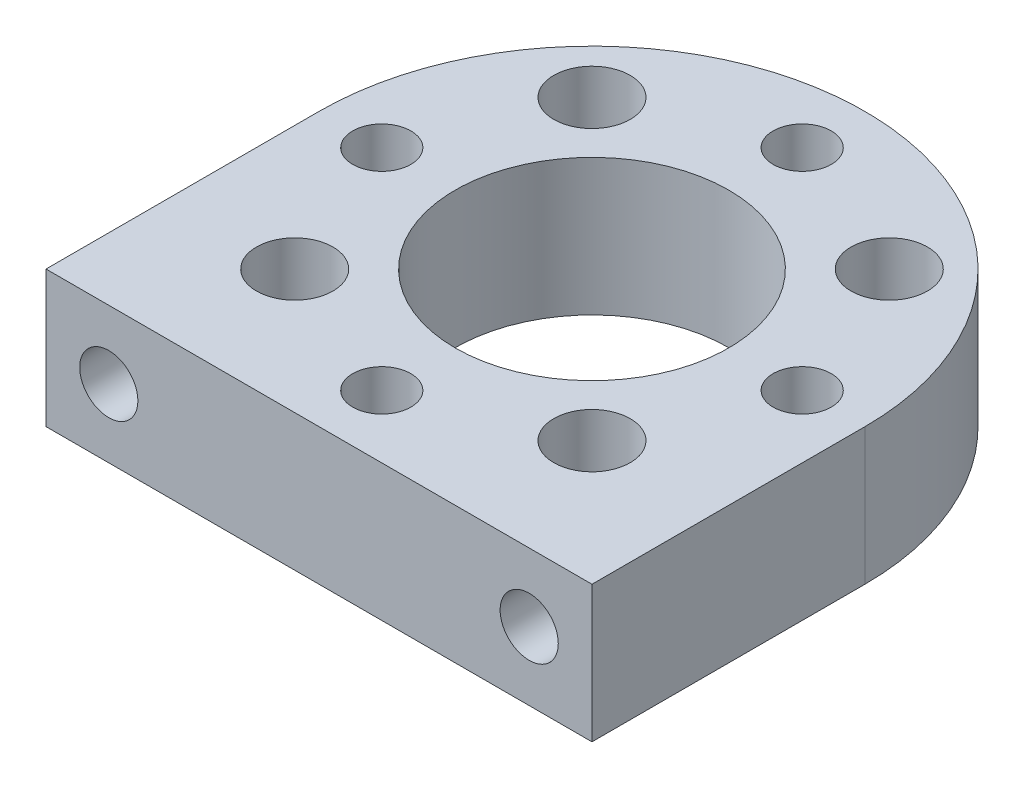
ISO-10303-21;
HEADER;
FILE_DESCRIPTION(('STEP AP214'),'2;1');
FILE_NAME('part.step','',(''),(''),'','','');
FILE_SCHEMA(('AUTOMOTIVE_DESIGN { 1 0 10303 214 1 1 1 1 }'));
ENDSEC;
DATA;
#1=APPLICATION_CONTEXT('core data for automotive mechanical design processes');
#2=APPLICATION_PROTOCOL_DEFINITION('international standard','automotive_design',2000,#1);
#3=PRODUCT_CONTEXT('',#1,'mechanical');
#4=PRODUCT('Part','Part','',(#3));
#5=PRODUCT_RELATED_PRODUCT_CATEGORY('part','',(#4));
#6=PRODUCT_DEFINITION_FORMATION('','',#4);
#7=PRODUCT_DEFINITION_CONTEXT('part definition',#1,'design');
#8=PRODUCT_DEFINITION('design','',#6,#7);
#9=PRODUCT_DEFINITION_SHAPE('','',#8);
#10=(LENGTH_UNIT() NAMED_UNIT(*) SI_UNIT(.MILLI.,.METRE.));
#11=(NAMED_UNIT(*) PLANE_ANGLE_UNIT() SI_UNIT($,.RADIAN.));
#12=(NAMED_UNIT(*) SI_UNIT($,.STERADIAN.) SOLID_ANGLE_UNIT());
#13=UNCERTAINTY_MEASURE_WITH_UNIT(LENGTH_MEASURE(1.E-05),#10,'distance_accuracy_value','');
#14=(GEOMETRIC_REPRESENTATION_CONTEXT(3) GLOBAL_UNCERTAINTY_ASSIGNED_CONTEXT((#13)) GLOBAL_UNIT_ASSIGNED_CONTEXT((#10,
#11,#12)) REPRESENTATION_CONTEXT('',''));
#15=CARTESIAN_POINT('',(0.,0.,0.));
#16=DIRECTION('',(0.,0.,1.));
#17=DIRECTION('',(1.,0.,0.));
#18=AXIS2_PLACEMENT_3D('',#15,#16,#17);
#19=CARTESIAN_POINT('',(-9.779,3.175,8.38200000004008));
#20=DIRECTION('',(0.,0.,1.));
#21=DIRECTION('',(1.,0.,0.));
#22=AXIS2_PLACEMENT_3D('',#19,#20,#21);
#23=CONICAL_SURFACE('',#22,1.35255000011194,1.02974425867655);
#24=CARTESIAN_POINT('',(-9.77899999980991,3.175,7.5693059697528));
#25=VERTEX_POINT('',#24);
#26=VERTEX_LOOP('',#25);
#27=FACE_BOUND('',#26,.T.);
#28=CARTESIAN_POINT('',(-9.779,3.175,8.382));
#29=DIRECTION('',(0.,0.,1.));
#30=DIRECTION('',(1.,0.,0.));
#31=AXIS2_PLACEMENT_3D('',#28,#29,#30);
#32=CIRCLE('',#31,1.35254999999999);
#33=CARTESIAN_POINT('',(-8.42645000000001,3.175,8.382));
#34=VERTEX_POINT('',#33);
#35=EDGE_CURVE('E167',#34,#34,#32,.T.);
#36=ORIENTED_EDGE('',*,*,#35,.T.);
#37=EDGE_LOOP('',(#36));
#38=FACE_BOUND('',#37,.T.);
#39=ADVANCED_FACE('F17',(#27,#38),#23,.F.);
#40=CARTESIAN_POINT('',(9.779,3.175,8.38199999998324));
#41=DIRECTION('',(0.,0.,1.));
#42=DIRECTION('',(1.,0.,0.));
#43=AXIS2_PLACEMENT_3D('',#40,#41,#42);
#44=CONICAL_SURFACE('',#43,1.35255000012966,1.0297442587012);
#45=CARTESIAN_POINT('',(9.77900000015097,3.175,7.56930596978123));
#46=VERTEX_POINT('',#45);
#47=VERTEX_LOOP('',#46);
#48=FACE_BOUND('',#47,.T.);
#49=CARTESIAN_POINT('',(9.779,3.175,8.382));
#50=DIRECTION('',(0.,0.,1.));
#51=DIRECTION('',(1.,0.,0.));
#52=AXIS2_PLACEMENT_3D('',#49,#50,#51);
#53=CIRCLE('',#52,1.35254999999999);
#54=CARTESIAN_POINT('',(11.13155,3.175,8.382));
#55=VERTEX_POINT('',#54);
#56=EDGE_CURVE('E163',#55,#55,#53,.T.);
#57=ORIENTED_EDGE('',*,*,#56,.T.);
#58=EDGE_LOOP('',(#57));
#59=FACE_BOUND('',#58,.T.);
#60=ADVANCED_FACE('F263',(#48,#59),#44,.F.);
#61=CARTESIAN_POINT('',(-9.779,3.175,12.7));
#62=DIRECTION('',(0.,0.,1.));
#63=DIRECTION('',(1.,0.,0.));
#64=AXIS2_PLACEMENT_3D('',#61,#62,#63);
#65=CYLINDRICAL_SURFACE('',#64,1.35254999999999);
#66=CARTESIAN_POINT('',(-9.779,3.175,12.7));
#67=DIRECTION('',(0.,0.,1.));
#68=DIRECTION('',(1.,0.,0.));
#69=AXIS2_PLACEMENT_3D('',#66,#67,#68);
#70=CIRCLE('',#69,1.35254999999999);
#71=CARTESIAN_POINT('',(-8.42645000000001,3.175,12.7));
#72=VERTEX_POINT('',#71);
#73=EDGE_CURVE('E135',#72,#72,#70,.F.);
#74=ORIENTED_EDGE('',*,*,#73,.F.);
#75=EDGE_LOOP('',(#74));
#76=FACE_BOUND('',#75,.T.);
#77=ORIENTED_EDGE('',*,*,#35,.F.);
#78=EDGE_LOOP('',(#77));
#79=FACE_BOUND('',#78,.T.);
#80=ADVANCED_FACE('F260',(#76,#79),#65,.F.);
#81=CARTESIAN_POINT('',(9.779,3.175,12.7));
#82=DIRECTION('',(0.,0.,1.));
#83=DIRECTION('',(1.,0.,0.));
#84=AXIS2_PLACEMENT_3D('',#81,#82,#83);
#85=CYLINDRICAL_SURFACE('',#84,1.35254999999999);
#86=CARTESIAN_POINT('',(9.779,3.175,12.7));
#87=DIRECTION('',(0.,0.,1.));
#88=DIRECTION('',(1.,0.,0.));
#89=AXIS2_PLACEMENT_3D('',#86,#87,#88);
#90=CIRCLE('',#89,1.35254999999999);
#91=CARTESIAN_POINT('',(11.13155,3.175,12.7));
#92=VERTEX_POINT('',#91);
#93=EDGE_CURVE('E131',#92,#92,#90,.F.);
#94=ORIENTED_EDGE('',*,*,#93,.F.);
#95=EDGE_LOOP('',(#94));
#96=FACE_BOUND('',#95,.T.);
#97=ORIENTED_EDGE('',*,*,#56,.F.);
#98=EDGE_LOOP('',(#97));
#99=FACE_BOUND('',#98,.T.);
#100=ADVANCED_FACE('F257',(#96,#99),#85,.F.);
#101=CARTESIAN_POINT('',(0.,0.,0.));
#102=DIRECTION('',(0.,1.,0.));
#103=DIRECTION('',(0.,0.,1.));
#104=AXIS2_PLACEMENT_3D('',#101,#102,#103);
#105=PLANE('',#104);
#106=DIRECTION('',(0.,0.,-1.));
#107=VECTOR('',#106,1.);
#108=CARTESIAN_POINT('',(12.7,0.,0.));
#109=LINE('',#108,#107);
#110=CARTESIAN_POINT('',(12.7,0.,12.7));
#111=VERTEX_POINT('',#110);
#112=CARTESIAN_POINT('',(12.7,0.,0.));
#113=VERTEX_POINT('',#112);
#114=EDGE_CURVE('E58',#111,#113,#109,.T.);
#115=ORIENTED_EDGE('',*,*,#114,.F.);
#116=DIRECTION('',(1.,0.,0.));
#117=VECTOR('',#116,1.);
#118=CARTESIAN_POINT('',(0.,0.,12.7));
#119=LINE('',#118,#117);
#120=CARTESIAN_POINT('',(-12.7,0.,12.7));
#121=VERTEX_POINT('',#120);
#122=EDGE_CURVE('E134',#121,#111,#119,.T.);
#123=ORIENTED_EDGE('',*,*,#122,.F.);
#124=DIRECTION('',(0.,0.,1.));
#125=VECTOR('',#124,1.);
#126=CARTESIAN_POINT('',(-12.7,0.,0.));
#127=LINE('',#126,#125);
#128=CARTESIAN_POINT('',(-12.7,0.,0.));
#129=VERTEX_POINT('',#128);
#130=EDGE_CURVE('E48',#129,#121,#127,.T.);
#131=ORIENTED_EDGE('',*,*,#130,.F.);
#132=CARTESIAN_POINT('',(0.,0.,0.));
#133=DIRECTION('',(0.,-1.,0.));
#134=DIRECTION('',(0.,0.,-1.));
#135=AXIS2_PLACEMENT_3D('',#132,#133,#134);
#136=CIRCLE('',#135,12.7);
#137=EDGE_CURVE('E54',#113,#129,#136,.F.);
#138=ORIENTED_EDGE('',*,*,#137,.F.);
#139=EDGE_LOOP('',(#115,#123,#131,#138));
#140=FACE_BOUND('',#139,.T.);
#141=CARTESIAN_POINT('',(0.,0.,0.));
#142=DIRECTION('',(0.,1.,0.));
#143=DIRECTION('',(0.,0.,1.));
#144=AXIS2_PLACEMENT_3D('',#141,#142,#143);
#145=CIRCLE('',#144,6.3627);
#146=CARTESIAN_POINT('',(0.,0.,6.3627));
#147=VERTEX_POINT('',#146);
#148=EDGE_CURVE('E138',#147,#147,#145,.T.);
#149=ORIENTED_EDGE('',*,*,#148,.T.);
#150=EDGE_LOOP('',(#149));
#151=FACE_BOUND('',#150,.T.);
#152=CARTESIAN_POINT('',(9.779,0.,0.));
#153=DIRECTION('',(0.,1.,0.));
#154=DIRECTION('',(0.,0.,1.));
#155=AXIS2_PLACEMENT_3D('',#152,#153,#154);
#156=CIRCLE('',#155,1.35254999999999);
#157=CARTESIAN_POINT('',(9.779,0.,1.35254999999999));
#158=VERTEX_POINT('',#157);
#159=EDGE_CURVE('E141',#158,#158,#156,.T.);
#160=ORIENTED_EDGE('',*,*,#159,.T.);
#161=EDGE_LOOP('',(#160));
#162=FACE_BOUND('',#161,.T.);
#163=CARTESIAN_POINT('',(0.,0.,-9.779));
#164=DIRECTION('',(0.,1.,0.));
#165=DIRECTION('',(0.,0.,1.));
#166=AXIS2_PLACEMENT_3D('',#163,#164,#165);
#167=CIRCLE('',#166,1.35254999999999);
#168=CARTESIAN_POINT('',(0.,0.,-8.42645000000001));
#169=VERTEX_POINT('',#168);
#170=EDGE_CURVE('E144',#169,#169,#167,.T.);
#171=ORIENTED_EDGE('',*,*,#170,.T.);
#172=EDGE_LOOP('',(#171));
#173=FACE_BOUND('',#172,.T.);
#174=CARTESIAN_POINT('',(-9.779,0.,0.));
#175=DIRECTION('',(0.,1.,0.));
#176=DIRECTION('',(0.,0.,1.));
#177=AXIS2_PLACEMENT_3D('',#174,#175,#176);
#178=CIRCLE('',#177,1.35254999999999);
#179=CARTESIAN_POINT('',(-9.779,0.,1.35254999999999));
#180=VERTEX_POINT('',#179);
#181=EDGE_CURVE('E147',#180,#180,#178,.T.);
#182=ORIENTED_EDGE('',*,*,#181,.T.);
#183=EDGE_LOOP('',(#182));
#184=FACE_BOUND('',#183,.T.);
#185=CARTESIAN_POINT('',(1.02429588037641E-13,0.,9.779));
#186=DIRECTION('',(0.,1.,0.));
#187=DIRECTION('',(0.,0.,1.));
#188=AXIS2_PLACEMENT_3D('',#185,#186,#187);
#189=CIRCLE('',#188,1.35254999999999);
#190=CARTESIAN_POINT('',(1.02429588037641E-13,0.,11.13155));
#191=VERTEX_POINT('',#190);
#192=EDGE_CURVE('E150',#191,#191,#189,.T.);
#193=ORIENTED_EDGE('',*,*,#192,.T.);
#194=EDGE_LOOP('',(#193));
#195=FACE_BOUND('',#194,.T.);
#196=CARTESIAN_POINT('',(6.91479721322331,0.,-6.91479721322318));
#197=DIRECTION('',(0.,1.,0.));
#198=DIRECTION('',(0.,0.,1.));
#199=AXIS2_PLACEMENT_3D('',#196,#197,#198);
#200=CIRCLE('',#199,1.778);
#201=CARTESIAN_POINT('',(6.91479721322331,0.,-5.13679721322318));
#202=VERTEX_POINT('',#201);
#203=EDGE_CURVE('E153',#202,#202,#200,.T.);
#204=ORIENTED_EDGE('',*,*,#203,.T.);
#205=EDGE_LOOP('',(#204));
#206=FACE_BOUND('',#205,.T.);
#207=CARTESIAN_POINT('',(-6.91479721322321,0.,-6.91479721322329));
#208=DIRECTION('',(0.,1.,0.));
#209=DIRECTION('',(0.,0.,1.));
#210=AXIS2_PLACEMENT_3D('',#207,#208,#209);
#211=CIRCLE('',#210,1.778);
#212=CARTESIAN_POINT('',(-6.91479721322321,0.,-5.13679721322329));
#213=VERTEX_POINT('',#212);
#214=EDGE_CURVE('E156',#213,#213,#211,.T.);
#215=ORIENTED_EDGE('',*,*,#214,.T.);
#216=EDGE_LOOP('',(#215));
#217=FACE_BOUND('',#216,.T.);
#218=CARTESIAN_POINT('',(-6.91479721322331,0.,6.91479721322318));
#219=DIRECTION('',(0.,1.,0.));
#220=DIRECTION('',(0.,0.,1.));
#221=AXIS2_PLACEMENT_3D('',#218,#219,#220);
#222=CIRCLE('',#221,1.778);
#223=CARTESIAN_POINT('',(-6.91479721322331,0.,8.69279721322318));
#224=VERTEX_POINT('',#223);
#225=EDGE_CURVE('E158',#224,#224,#222,.T.);
#226=ORIENTED_EDGE('',*,*,#225,.T.);
#227=EDGE_LOOP('',(#226));
#228=FACE_BOUND('',#227,.T.);
#229=CARTESIAN_POINT('',(6.91479721322325,0.,6.91479721322324));
#230=DIRECTION('',(0.,1.,0.));
#231=DIRECTION('',(0.,0.,1.));
#232=AXIS2_PLACEMENT_3D('',#229,#230,#231);
#233=CIRCLE('',#232,1.778);
#234=CARTESIAN_POINT('',(6.91479721322325,0.,8.69279721322324));
#235=VERTEX_POINT('',#234);
#236=EDGE_CURVE('E20',#235,#235,#233,.T.);
#237=ORIENTED_EDGE('',*,*,#236,.T.);
#238=EDGE_LOOP('',(#237));
#239=FACE_BOUND('',#238,.T.);
#240=ADVANCED_FACE('F254',(#140,#151,#162,#173,#184,#195,#206,#217,#228,#239),#105,.F.);
#241=CARTESIAN_POINT('',(6.91479721322325,6.35,6.91479721322324));
#242=DIRECTION('',(0.,1.,0.));
#243=DIRECTION('',(0.,0.,1.));
#244=AXIS2_PLACEMENT_3D('',#241,#242,#243);
#245=CYLINDRICAL_SURFACE('',#244,1.778);
#246=CARTESIAN_POINT('',(6.91479721322325,6.35,6.91479721322324));
#247=DIRECTION('',(0.,1.,0.));
#248=DIRECTION('',(0.,0.,1.));
#249=AXIS2_PLACEMENT_3D('',#246,#247,#248);
#250=CIRCLE('',#249,1.778);
#251=CARTESIAN_POINT('',(6.91479721322325,6.35,8.69279721322324));
#252=VERTEX_POINT('',#251);
#253=EDGE_CURVE('E122',#252,#252,#250,.F.);
#254=ORIENTED_EDGE('',*,*,#253,.F.);
#255=EDGE_LOOP('',(#254));
#256=FACE_BOUND('',#255,.T.);
#257=ORIENTED_EDGE('',*,*,#236,.F.);
#258=EDGE_LOOP('',(#257));
#259=FACE_BOUND('',#258,.T.);
#260=ADVANCED_FACE('F250',(#256,#259),#245,.F.);
#261=CARTESIAN_POINT('',(-6.91479721322331,6.35,6.91479721322318));
#262=DIRECTION('',(0.,1.,0.));
#263=DIRECTION('',(0.,0.,1.));
#264=AXIS2_PLACEMENT_3D('',#261,#262,#263);
#265=CYLINDRICAL_SURFACE('',#264,1.778);
#266=CARTESIAN_POINT('',(-6.91479721322331,6.35,6.91479721322318));
#267=DIRECTION('',(0.,1.,0.));
#268=DIRECTION('',(0.,0.,1.));
#269=AXIS2_PLACEMENT_3D('',#266,#267,#268);
#270=CIRCLE('',#269,1.778);
#271=CARTESIAN_POINT('',(-6.91479721322331,6.35,8.69279721322318));
#272=VERTEX_POINT('',#271);
#273=EDGE_CURVE('E119',#272,#272,#270,.F.);
#274=ORIENTED_EDGE('',*,*,#273,.F.);
#275=EDGE_LOOP('',(#274));
#276=FACE_BOUND('',#275,.T.);
#277=ORIENTED_EDGE('',*,*,#225,.F.);
#278=EDGE_LOOP('',(#277));
#279=FACE_BOUND('',#278,.T.);
#280=ADVANCED_FACE('F246',(#276,#279),#265,.F.);
#281=CARTESIAN_POINT('',(-6.91479721322321,6.35,-6.91479721322329));
#282=DIRECTION('',(0.,1.,0.));
#283=DIRECTION('',(0.,0.,1.));
#284=AXIS2_PLACEMENT_3D('',#281,#282,#283);
#285=CYLINDRICAL_SURFACE('',#284,1.778);
#286=CARTESIAN_POINT('',(-6.91479721322321,6.35,-6.91479721322329));
#287=DIRECTION('',(0.,1.,0.));
#288=DIRECTION('',(0.,0.,1.));
#289=AXIS2_PLACEMENT_3D('',#286,#287,#288);
#290=CIRCLE('',#289,1.778);
#291=CARTESIAN_POINT('',(-6.91479721322321,6.35,-5.13679721322329));
#292=VERTEX_POINT('',#291);
#293=EDGE_CURVE('E115',#292,#292,#290,.F.);
#294=ORIENTED_EDGE('',*,*,#293,.F.);
#295=EDGE_LOOP('',(#294));
#296=FACE_BOUND('',#295,.T.);
#297=ORIENTED_EDGE('',*,*,#214,.F.);
#298=EDGE_LOOP('',(#297));
#299=FACE_BOUND('',#298,.T.);
#300=ADVANCED_FACE('F242',(#296,#299),#285,.F.);
#301=CARTESIAN_POINT('',(6.91479721322331,6.35,-6.91479721322318));
#302=DIRECTION('',(0.,1.,0.));
#303=DIRECTION('',(0.,0.,1.));
#304=AXIS2_PLACEMENT_3D('',#301,#302,#303);
#305=CYLINDRICAL_SURFACE('',#304,1.778);
#306=CARTESIAN_POINT('',(6.91479721322331,6.35,-6.91479721322318));
#307=DIRECTION('',(0.,1.,0.));
#308=DIRECTION('',(0.,0.,1.));
#309=AXIS2_PLACEMENT_3D('',#306,#307,#308);
#310=CIRCLE('',#309,1.778);
#311=CARTESIAN_POINT('',(6.91479721322331,6.35,-5.13679721322318));
#312=VERTEX_POINT('',#311);
#313=EDGE_CURVE('E111',#312,#312,#310,.F.);
#314=ORIENTED_EDGE('',*,*,#313,.F.);
#315=EDGE_LOOP('',(#314));
#316=FACE_BOUND('',#315,.T.);
#317=ORIENTED_EDGE('',*,*,#203,.F.);
#318=EDGE_LOOP('',(#317));
#319=FACE_BOUND('',#318,.T.);
#320=ADVANCED_FACE('F238',(#316,#319),#305,.F.);
#321=CARTESIAN_POINT('',(1.02429588037641E-13,6.35,9.779));
#322=DIRECTION('',(0.,1.,0.));
#323=DIRECTION('',(0.,0.,1.));
#324=AXIS2_PLACEMENT_3D('',#321,#322,#323);
#325=CYLINDRICAL_SURFACE('',#324,1.35254999999999);
#326=CARTESIAN_POINT('',(1.02429588037641E-13,6.35,9.779));
#327=DIRECTION('',(0.,1.,0.));
#328=DIRECTION('',(0.,0.,1.));
#329=AXIS2_PLACEMENT_3D('',#326,#327,#328);
#330=CIRCLE('',#329,1.35254999999999);
#331=CARTESIAN_POINT('',(1.02429588037641E-13,6.35,11.13155));
#332=VERTEX_POINT('',#331);
#333=EDGE_CURVE('E107',#332,#332,#330,.F.);
#334=ORIENTED_EDGE('',*,*,#333,.F.);
#335=EDGE_LOOP('',(#334));
#336=FACE_BOUND('',#335,.T.);
#337=ORIENTED_EDGE('',*,*,#192,.F.);
#338=EDGE_LOOP('',(#337));
#339=FACE_BOUND('',#338,.T.);
#340=ADVANCED_FACE('F234',(#336,#339),#325,.F.);
#341=CARTESIAN_POINT('',(-9.779,6.35,0.));
#342=DIRECTION('',(0.,1.,0.));
#343=DIRECTION('',(0.,0.,1.));
#344=AXIS2_PLACEMENT_3D('',#341,#342,#343);
#345=CYLINDRICAL_SURFACE('',#344,1.35254999999999);
#346=CARTESIAN_POINT('',(-9.779,6.35,0.));
#347=DIRECTION('',(0.,1.,0.));
#348=DIRECTION('',(0.,0.,1.));
#349=AXIS2_PLACEMENT_3D('',#346,#347,#348);
#350=CIRCLE('',#349,1.35254999999999);
#351=CARTESIAN_POINT('',(-9.779,6.35,1.35254999999999));
#352=VERTEX_POINT('',#351);
#353=EDGE_CURVE('E103',#352,#352,#350,.F.);
#354=ORIENTED_EDGE('',*,*,#353,.F.);
#355=EDGE_LOOP('',(#354));
#356=FACE_BOUND('',#355,.T.);
#357=ORIENTED_EDGE('',*,*,#181,.F.);
#358=EDGE_LOOP('',(#357));
#359=FACE_BOUND('',#358,.T.);
#360=ADVANCED_FACE('F230',(#356,#359),#345,.F.);
#361=CARTESIAN_POINT('',(0.,6.35,-9.779));
#362=DIRECTION('',(0.,1.,0.));
#363=DIRECTION('',(0.,0.,1.));
#364=AXIS2_PLACEMENT_3D('',#361,#362,#363);
#365=CYLINDRICAL_SURFACE('',#364,1.35254999999999);
#366=CARTESIAN_POINT('',(0.,6.35,-9.779));
#367=DIRECTION('',(0.,1.,0.));
#368=DIRECTION('',(0.,0.,1.));
#369=AXIS2_PLACEMENT_3D('',#366,#367,#368);
#370=CIRCLE('',#369,1.35254999999999);
#371=CARTESIAN_POINT('',(0.,6.35,-8.42645000000001));
#372=VERTEX_POINT('',#371);
#373=EDGE_CURVE('E99',#372,#372,#370,.F.);
#374=ORIENTED_EDGE('',*,*,#373,.F.);
#375=EDGE_LOOP('',(#374));
#376=FACE_BOUND('',#375,.T.);
#377=ORIENTED_EDGE('',*,*,#170,.F.);
#378=EDGE_LOOP('',(#377));
#379=FACE_BOUND('',#378,.T.);
#380=ADVANCED_FACE('F226',(#376,#379),#365,.F.);
#381=CARTESIAN_POINT('',(9.779,6.35,0.));
#382=DIRECTION('',(0.,1.,0.));
#383=DIRECTION('',(0.,0.,1.));
#384=AXIS2_PLACEMENT_3D('',#381,#382,#383);
#385=CYLINDRICAL_SURFACE('',#384,1.35254999999999);
#386=CARTESIAN_POINT('',(9.779,6.35,0.));
#387=DIRECTION('',(0.,1.,0.));
#388=DIRECTION('',(0.,0.,1.));
#389=AXIS2_PLACEMENT_3D('',#386,#387,#388);
#390=CIRCLE('',#389,1.35254999999999);
#391=CARTESIAN_POINT('',(9.779,6.35,1.35254999999999));
#392=VERTEX_POINT('',#391);
#393=EDGE_CURVE('E95',#392,#392,#390,.F.);
#394=ORIENTED_EDGE('',*,*,#393,.F.);
#395=EDGE_LOOP('',(#394));
#396=FACE_BOUND('',#395,.T.);
#397=ORIENTED_EDGE('',*,*,#159,.F.);
#398=EDGE_LOOP('',(#397));
#399=FACE_BOUND('',#398,.T.);
#400=ADVANCED_FACE('F222',(#396,#399),#385,.F.);
#401=CARTESIAN_POINT('',(0.,6.35,0.));
#402=DIRECTION('',(0.,1.,0.));
#403=DIRECTION('',(0.,0.,1.));
#404=AXIS2_PLACEMENT_3D('',#401,#402,#403);
#405=CYLINDRICAL_SURFACE('',#404,6.3627);
#406=CARTESIAN_POINT('',(0.,6.35,0.));
#407=DIRECTION('',(0.,1.,0.));
#408=DIRECTION('',(0.,0.,1.));
#409=AXIS2_PLACEMENT_3D('',#406,#407,#408);
#410=CIRCLE('',#409,6.3627);
#411=CARTESIAN_POINT('',(0.,6.35,6.3627));
#412=VERTEX_POINT('',#411);
#413=EDGE_CURVE('E77',#412,#412,#410,.F.);
#414=ORIENTED_EDGE('',*,*,#413,.F.);
#415=EDGE_LOOP('',(#414));
#416=FACE_BOUND('',#415,.T.);
#417=ORIENTED_EDGE('',*,*,#148,.F.);
#418=EDGE_LOOP('',(#417));
#419=FACE_BOUND('',#418,.T.);
#420=ADVANCED_FACE('F219',(#416,#419),#405,.F.);
#421=CARTESIAN_POINT('',(0.,-17.9605122421383,12.7));
#422=DIRECTION('',(0.,0.,1.));
#423=DIRECTION('',(1.,0.,0.));
#424=AXIS2_PLACEMENT_3D('',#421,#422,#423);
#425=PLANE('',#424);
#426=DIRECTION('',(1.,0.,0.));
#427=VECTOR('',#426,1.);
#428=CARTESIAN_POINT('',(0.,6.35,12.7));
#429=LINE('',#428,#427);
#430=CARTESIAN_POINT('',(-12.7,6.35,12.7));
#431=VERTEX_POINT('',#430);
#432=CARTESIAN_POINT('',(12.7,6.35,12.7));
#433=VERTEX_POINT('',#432);
#434=EDGE_CURVE('E68',#431,#433,#429,.T.);
#435=ORIENTED_EDGE('',*,*,#434,.F.);
#436=DIRECTION('',(0.,1.,0.));
#437=VECTOR('',#436,1.);
#438=CARTESIAN_POINT('',(-12.7,-17.9605122421383,12.7));
#439=LINE('',#438,#437);
#440=EDGE_CURVE('E72',#121,#431,#439,.T.);
#441=ORIENTED_EDGE('',*,*,#440,.F.);
#442=ORIENTED_EDGE('',*,*,#122,.T.);
#443=DIRECTION('',(0.,1.,0.));
#444=VECTOR('',#443,1.);
#445=CARTESIAN_POINT('',(12.7,-17.9605122421383,12.7));
#446=LINE('',#445,#444);
#447=EDGE_CURVE('E74',#433,#111,#446,.F.);
#448=ORIENTED_EDGE('',*,*,#447,.F.);
#449=EDGE_LOOP('',(#435,#441,#442,#448));
#450=FACE_BOUND('',#449,.T.);
#451=ORIENTED_EDGE('',*,*,#93,.T.);
#452=EDGE_LOOP('',(#451));
#453=FACE_BOUND('',#452,.T.);
#454=ORIENTED_EDGE('',*,*,#73,.T.);
#455=EDGE_LOOP('',(#454));
#456=FACE_BOUND('',#455,.T.);
#457=ADVANCED_FACE('F70',(#450,#453,#456),#425,.T.);
#458=CARTESIAN_POINT('',(12.7,-17.9605122421383,0.));
#459=DIRECTION('',(1.,0.,0.));
#460=DIRECTION('',(0.,0.,-1.));
#461=AXIS2_PLACEMENT_3D('',#458,#459,#460);
#462=PLANE('',#461);
#463=DIRECTION('',(0.,0.,1.));
#464=VECTOR('',#463,1.);
#465=CARTESIAN_POINT('',(12.7,6.35,0.));
#466=LINE('',#465,#464);
#467=CARTESIAN_POINT('',(12.7,6.35,0.));
#468=VERTEX_POINT('',#467);
#469=EDGE_CURVE('E76',#433,#468,#466,.F.);
#470=ORIENTED_EDGE('',*,*,#469,.F.);
#471=ORIENTED_EDGE('',*,*,#447,.T.);
#472=ORIENTED_EDGE('',*,*,#114,.T.);
#473=DIRECTION('',(0.,-1.,0.));
#474=VECTOR('',#473,1.);
#475=CARTESIAN_POINT('',(12.7,6.35,0.));
#476=LINE('',#475,#474);
#477=EDGE_CURVE('E130',#468,#113,#476,.T.);
#478=ORIENTED_EDGE('',*,*,#477,.F.);
#479=EDGE_LOOP('',(#470,#471,#472,#478));
#480=FACE_BOUND('',#479,.T.);
#481=ADVANCED_FACE('F204',(#480),#462,.T.);
#482=CARTESIAN_POINT('',(0.,6.35,0.));
#483=DIRECTION('',(0.,-1.,0.));
#484=DIRECTION('',(0.,0.,-1.));
#485=AXIS2_PLACEMENT_3D('',#482,#483,#484);
#486=CYLINDRICAL_SURFACE('',#485,12.7);
#487=ORIENTED_EDGE('',*,*,#137,.T.);
#488=DIRECTION('',(0.,1.,0.));
#489=VECTOR('',#488,1.);
#490=CARTESIAN_POINT('',(-12.7,-17.9605122421383,0.));
#491=LINE('',#490,#489);
#492=CARTESIAN_POINT('',(-12.7,6.35,0.));
#493=VERTEX_POINT('',#492);
#494=EDGE_CURVE('E83',#493,#129,#491,.F.);
#495=ORIENTED_EDGE('',*,*,#494,.F.);
#496=CARTESIAN_POINT('',(0.,6.35,0.));
#497=DIRECTION('',(0.,-1.,0.));
#498=DIRECTION('',(0.,0.,-1.));
#499=AXIS2_PLACEMENT_3D('',#496,#497,#498);
#500=CIRCLE('',#499,12.7);
#501=EDGE_CURVE('E26',#468,#493,#500,.F.);
#502=ORIENTED_EDGE('',*,*,#501,.F.);
#503=ORIENTED_EDGE('',*,*,#477,.T.);
#504=EDGE_LOOP('',(#487,#495,#502,#503));
#505=FACE_BOUND('',#504,.T.);
#506=ADVANCED_FACE('F206',(#505),#486,.T.);
#507=CARTESIAN_POINT('',(-12.7,-17.9605122421383,0.));
#508=DIRECTION('',(-1.,0.,0.));
#509=DIRECTION('',(0.,0.,1.));
#510=AXIS2_PLACEMENT_3D('',#507,#508,#509);
#511=PLANE('',#510);
#512=DIRECTION('',(0.,0.,1.));
#513=VECTOR('',#512,1.);
#514=CARTESIAN_POINT('',(-12.7,6.35,0.));
#515=LINE('',#514,#513);
#516=EDGE_CURVE('E10',#493,#431,#515,.T.);
#517=ORIENTED_EDGE('',*,*,#516,.F.);
#518=ORIENTED_EDGE('',*,*,#494,.T.);
#519=ORIENTED_EDGE('',*,*,#130,.T.);
#520=ORIENTED_EDGE('',*,*,#440,.T.);
#521=EDGE_LOOP('',(#517,#518,#519,#520));
#522=FACE_BOUND('',#521,.T.);
#523=ADVANCED_FACE('F81',(#522),#511,.T.);
#524=CARTESIAN_POINT('',(0.,6.35,0.));
#525=DIRECTION('',(0.,1.,0.));
#526=DIRECTION('',(0.,0.,1.));
#527=AXIS2_PLACEMENT_3D('',#524,#525,#526);
#528=PLANE('',#527);
#529=ORIENTED_EDGE('',*,*,#501,.T.);
#530=ORIENTED_EDGE('',*,*,#516,.T.);
#531=ORIENTED_EDGE('',*,*,#434,.T.);
#532=ORIENTED_EDGE('',*,*,#469,.T.);
#533=EDGE_LOOP('',(#529,#530,#531,#532));
#534=FACE_BOUND('',#533,.T.);
#535=ORIENTED_EDGE('',*,*,#413,.T.);
#536=EDGE_LOOP('',(#535));
#537=FACE_BOUND('',#536,.T.);
#538=ORIENTED_EDGE('',*,*,#393,.T.);
#539=EDGE_LOOP('',(#538));
#540=FACE_BOUND('',#539,.T.);
#541=ORIENTED_EDGE('',*,*,#373,.T.);
#542=EDGE_LOOP('',(#541));
#543=FACE_BOUND('',#542,.T.);
#544=ORIENTED_EDGE('',*,*,#353,.T.);
#545=EDGE_LOOP('',(#544));
#546=FACE_BOUND('',#545,.T.);
#547=ORIENTED_EDGE('',*,*,#333,.T.);
#548=EDGE_LOOP('',(#547));
#549=FACE_BOUND('',#548,.T.);
#550=ORIENTED_EDGE('',*,*,#313,.T.);
#551=EDGE_LOOP('',(#550));
#552=FACE_BOUND('',#551,.T.);
#553=ORIENTED_EDGE('',*,*,#293,.T.);
#554=EDGE_LOOP('',(#553));
#555=FACE_BOUND('',#554,.T.);
#556=ORIENTED_EDGE('',*,*,#273,.T.);
#557=EDGE_LOOP('',(#556));
#558=FACE_BOUND('',#557,.T.);
#559=ORIENTED_EDGE('',*,*,#253,.T.);
#560=EDGE_LOOP('',(#559));
#561=FACE_BOUND('',#560,.T.);
#562=ADVANCED_FACE('F85',(#534,#537,#540,#543,#546,#549,#552,#555,#558,#561),#528,.T.);
#563=CLOSED_SHELL('',(#39,#60,#80,#100,#240,#260,#280,#300,#320,#340,#360,#380,#400,#420,#457,
#481,#506,#523,#562));
#564=MANIFOLD_SOLID_BREP('B1',#563);
#565=ADVANCED_BREP_SHAPE_REPRESENTATION('',(#18,#564),#14);
#566=SHAPE_DEFINITION_REPRESENTATION(#9,#565);
ENDSEC;
END-ISO-10303-21;
